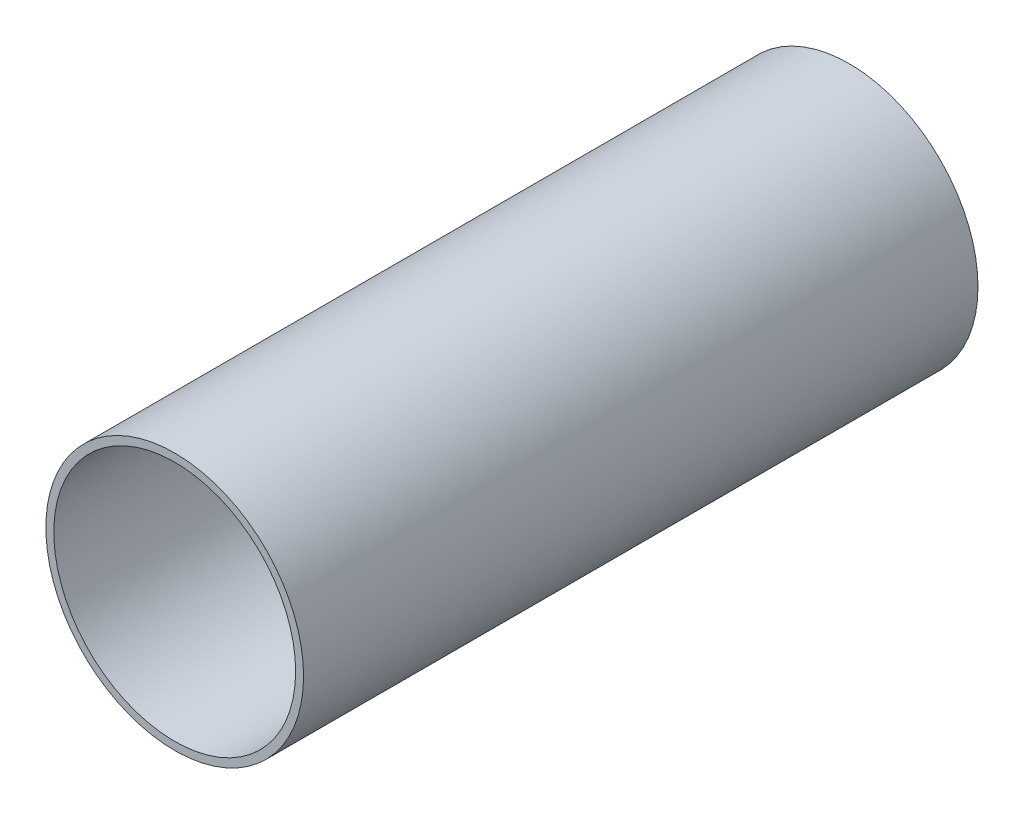
ISO-10303-21;
HEADER;
FILE_DESCRIPTION(('STEP AP214'),'2;1');
FILE_NAME('part.step','',(''),(''),'','','');
FILE_SCHEMA(('AUTOMOTIVE_DESIGN { 1 0 10303 214 1 1 1 1 }'));
ENDSEC;
DATA;
#1=APPLICATION_CONTEXT('core data for automotive mechanical design processes');
#2=APPLICATION_PROTOCOL_DEFINITION('international standard','automotive_design',2000,#1);
#3=PRODUCT_CONTEXT('',#1,'mechanical');
#4=PRODUCT('Part','Part','',(#3));
#5=PRODUCT_RELATED_PRODUCT_CATEGORY('part','',(#4));
#6=PRODUCT_DEFINITION_FORMATION('','',#4);
#7=PRODUCT_DEFINITION_CONTEXT('part definition',#1,'design');
#8=PRODUCT_DEFINITION('design','',#6,#7);
#9=PRODUCT_DEFINITION_SHAPE('','',#8);
#10=(LENGTH_UNIT() NAMED_UNIT(*) SI_UNIT(.MILLI.,.METRE.));
#11=(NAMED_UNIT(*) PLANE_ANGLE_UNIT() SI_UNIT($,.RADIAN.));
#12=(NAMED_UNIT(*) SI_UNIT($,.STERADIAN.) SOLID_ANGLE_UNIT());
#13=UNCERTAINTY_MEASURE_WITH_UNIT(LENGTH_MEASURE(1.E-05),#10,'distance_accuracy_value','');
#14=(GEOMETRIC_REPRESENTATION_CONTEXT(3) GLOBAL_UNCERTAINTY_ASSIGNED_CONTEXT((#13)) GLOBAL_UNIT_ASSIGNED_CONTEXT((#10,
#11,#12)) REPRESENTATION_CONTEXT('',''));
#15=CARTESIAN_POINT('',(0.,0.,0.));
#16=DIRECTION('',(0.,0.,1.));
#17=DIRECTION('',(1.,0.,0.));
#18=AXIS2_PLACEMENT_3D('',#15,#16,#17);
#19=CARTESIAN_POINT('',(2240.,0.,850.));
#20=DIRECTION('',(0.,0.,1.));
#21=DIRECTION('',(1.,0.,0.));
#22=AXIS2_PLACEMENT_3D('',#19,#20,#21);
#23=PLANE('',#22);
#24=CARTESIAN_POINT('',(2240.,0.,850.));
#25=DIRECTION('',(0.,0.,1.));
#26=DIRECTION('',(1.,0.,0.));
#27=AXIS2_PLACEMENT_3D('',#24,#25,#26);
#28=CIRCLE('',#27,162.4);
#29=CARTESIAN_POINT('',(2402.4,0.,850.));
#30=VERTEX_POINT('',#29);
#31=EDGE_CURVE('E11',#30,#30,#28,.T.);
#32=ORIENTED_EDGE('',*,*,#31,.T.);
#33=EDGE_LOOP('',(#32));
#34=FACE_BOUND('',#33,.T.);
#35=CARTESIAN_POINT('',(2240.,0.,850.));
#36=DIRECTION('',(0.,0.,1.));
#37=DIRECTION('',(1.,0.,0.));
#38=AXIS2_PLACEMENT_3D('',#35,#36,#37);
#39=CIRCLE('',#38,152.4);
#40=CARTESIAN_POINT('',(2392.4,0.,850.));
#41=VERTEX_POINT('',#40);
#42=EDGE_CURVE('E45',#41,#41,#39,.T.);
#43=ORIENTED_EDGE('',*,*,#42,.F.);
#44=EDGE_LOOP('',(#43));
#45=FACE_BOUND('',#44,.T.);
#46=ADVANCED_FACE('F34',(#34,#45),#23,.T.);
#47=CARTESIAN_POINT('',(2240.,0.,0.));
#48=DIRECTION('',(0.,0.,1.));
#49=DIRECTION('',(1.,0.,0.));
#50=AXIS2_PLACEMENT_3D('',#47,#48,#49);
#51=PLANE('',#50);
#52=CARTESIAN_POINT('',(2240.,0.,0.));
#53=DIRECTION('',(0.,0.,1.));
#54=DIRECTION('',(1.,0.,0.));
#55=AXIS2_PLACEMENT_3D('',#52,#53,#54);
#56=CIRCLE('',#55,162.4);
#57=CARTESIAN_POINT('',(2402.4,0.,0.));
#58=VERTEX_POINT('',#57);
#59=EDGE_CURVE('E38',#58,#58,#56,.T.);
#60=ORIENTED_EDGE('',*,*,#59,.F.);
#61=EDGE_LOOP('',(#60));
#62=FACE_BOUND('',#61,.T.);
#63=CARTESIAN_POINT('',(2240.,0.,0.));
#64=DIRECTION('',(0.,0.,1.));
#65=DIRECTION('',(1.,0.,0.));
#66=AXIS2_PLACEMENT_3D('',#63,#64,#65);
#67=CIRCLE('',#66,152.4);
#68=CARTESIAN_POINT('',(2392.4,0.,0.));
#69=VERTEX_POINT('',#68);
#70=EDGE_CURVE('E47',#69,#69,#67,.T.);
#71=ORIENTED_EDGE('',*,*,#70,.T.);
#72=EDGE_LOOP('',(#71));
#73=FACE_BOUND('',#72,.T.);
#74=ADVANCED_FACE('F57',(#62,#73),#51,.F.);
#75=CARTESIAN_POINT('',(2240.,0.,850.));
#76=DIRECTION('',(0.,0.,-1.));
#77=DIRECTION('',(-1.,0.,0.));
#78=AXIS2_PLACEMENT_3D('',#75,#76,#77);
#79=CYLINDRICAL_SURFACE('',#78,162.4);
#80=ORIENTED_EDGE('',*,*,#31,.F.);
#81=EDGE_LOOP('',(#80));
#82=FACE_BOUND('',#81,.T.);
#83=ORIENTED_EDGE('',*,*,#59,.T.);
#84=EDGE_LOOP('',(#83));
#85=FACE_BOUND('',#84,.T.);
#86=ADVANCED_FACE('F36',(#82,#85),#79,.T.);
#87=CARTESIAN_POINT('',(2240.,0.,850.));
#88=DIRECTION('',(0.,0.,-1.));
#89=DIRECTION('',(-1.,0.,0.));
#90=AXIS2_PLACEMENT_3D('',#87,#88,#89);
#91=CYLINDRICAL_SURFACE('',#90,152.4);
#92=ORIENTED_EDGE('',*,*,#42,.T.);
#93=EDGE_LOOP('',(#92));
#94=FACE_BOUND('',#93,.T.);
#95=ORIENTED_EDGE('',*,*,#70,.F.);
#96=EDGE_LOOP('',(#95));
#97=FACE_BOUND('',#96,.T.);
#98=ADVANCED_FACE('F53',(#94,#97),#91,.F.);
#99=CLOSED_SHELL('',(#46,#74,#86,#98));
#100=MANIFOLD_SOLID_BREP('B2',#99);
#101=ADVANCED_BREP_SHAPE_REPRESENTATION('',(#18,#100),#14);
#102=SHAPE_DEFINITION_REPRESENTATION(#9,#101);
ENDSEC;
END-ISO-10303-21;
